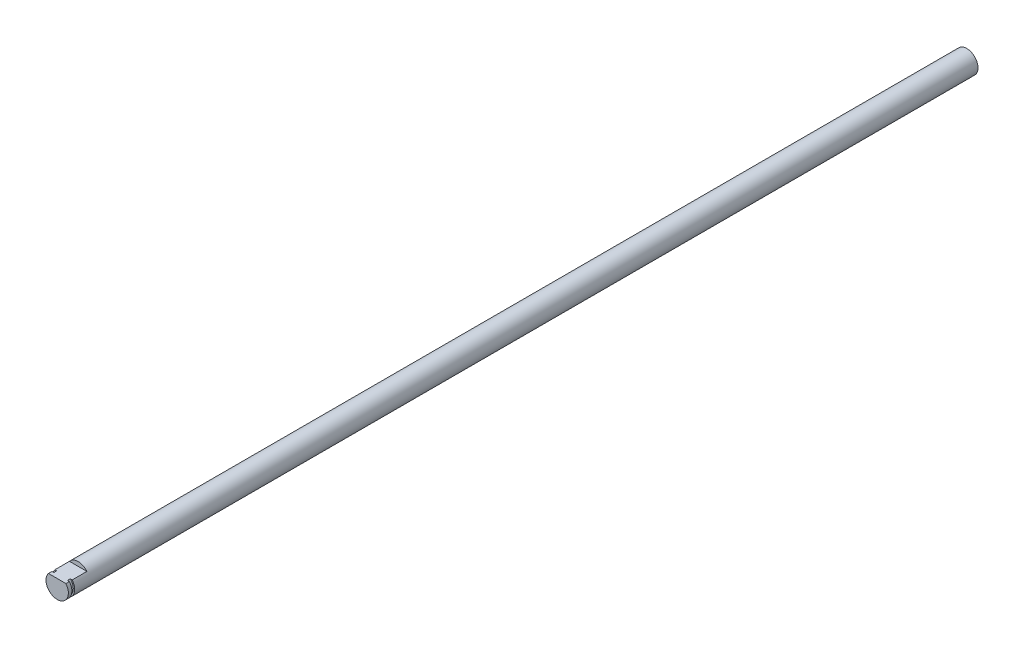
ISO-10303-21;
HEADER;
FILE_DESCRIPTION(('STEP AP214'),'2;1');
FILE_NAME('part.step','',(''),(''),'','','');
FILE_SCHEMA(('AUTOMOTIVE_DESIGN { 1 0 10303 214 1 1 1 1 }'));
ENDSEC;
DATA;
#1=APPLICATION_CONTEXT('core data for automotive mechanical design processes');
#2=APPLICATION_PROTOCOL_DEFINITION('international standard','automotive_design',2000,#1);
#3=PRODUCT_CONTEXT('',#1,'mechanical');
#4=PRODUCT('Part','Part','',(#3));
#5=PRODUCT_RELATED_PRODUCT_CATEGORY('part','',(#4));
#6=PRODUCT_DEFINITION_FORMATION('','',#4);
#7=PRODUCT_DEFINITION_CONTEXT('part definition',#1,'design');
#8=PRODUCT_DEFINITION('design','',#6,#7);
#9=PRODUCT_DEFINITION_SHAPE('','',#8);
#10=(LENGTH_UNIT() NAMED_UNIT(*) SI_UNIT(.MILLI.,.METRE.));
#11=(NAMED_UNIT(*) PLANE_ANGLE_UNIT() SI_UNIT($,.RADIAN.));
#12=(NAMED_UNIT(*) SI_UNIT($,.STERADIAN.) SOLID_ANGLE_UNIT());
#13=UNCERTAINTY_MEASURE_WITH_UNIT(LENGTH_MEASURE(1.E-05),#10,'distance_accuracy_value','');
#14=(GEOMETRIC_REPRESENTATION_CONTEXT(3) GLOBAL_UNCERTAINTY_ASSIGNED_CONTEXT((#13)) GLOBAL_UNIT_ASSIGNED_CONTEXT((#10,
#11,#12)) REPRESENTATION_CONTEXT('',''));
#15=CARTESIAN_POINT('',(0.,0.,0.));
#16=DIRECTION('',(0.,0.,1.));
#17=DIRECTION('',(1.,0.,0.));
#18=AXIS2_PLACEMENT_3D('',#15,#16,#17);
#19=CARTESIAN_POINT('',(0.,0.,325.));
#20=DIRECTION('',(0.,0.,-1.));
#21=DIRECTION('',(-1.,0.,0.));
#22=AXIS2_PLACEMENT_3D('',#19,#20,#21);
#23=CYLINDRICAL_SURFACE('',#22,4.);
#24=CARTESIAN_POINT('',(0.,0.,0.));
#25=DIRECTION('',(0.,0.,1.));
#26=DIRECTION('',(1.,0.,0.));
#27=AXIS2_PLACEMENT_3D('',#24,#25,#26);
#28=CIRCLE('',#27,4.);
#29=CARTESIAN_POINT('',(4.,0.,0.));
#30=VERTEX_POINT('',#29);
#31=EDGE_CURVE('E116',#30,#30,#28,.T.);
#32=ORIENTED_EDGE('',*,*,#31,.T.);
#33=EDGE_LOOP('',(#32));
#34=FACE_BOUND('',#33,.T.);
#35=CARTESIAN_POINT('',(0.,0.,322.75));
#36=DIRECTION('',(0.,0.,1.));
#37=DIRECTION('',(1.,0.,0.));
#38=AXIS2_PLACEMENT_3D('',#35,#36,#37);
#39=CIRCLE('',#38,4.);
#40=CARTESIAN_POINT('',(-3.1224989991992,2.5,322.75));
#41=VERTEX_POINT('',#40);
#42=CARTESIAN_POINT('',(3.1224989991992,2.5,322.75));
#43=VERTEX_POINT('',#42);
#44=EDGE_CURVE('E100',#41,#43,#39,.T.);
#45=ORIENTED_EDGE('',*,*,#44,.F.);
#46=DIRECTION('',(0.,0.,1.));
#47=VECTOR('',#46,1.);
#48=CARTESIAN_POINT('',(-3.1224989991992,2.5,317.5));
#49=LINE('',#48,#47);
#50=CARTESIAN_POINT('',(-3.1224989991992,2.5,317.5));
#51=VERTEX_POINT('',#50);
#52=EDGE_CURVE('E122',#51,#41,#49,.T.);
#53=ORIENTED_EDGE('',*,*,#52,.F.);
#54=CARTESIAN_POINT('',(0.,0.,317.5));
#55=DIRECTION('',(0.,0.,1.));
#56=DIRECTION('',(1.,0.,0.));
#57=AXIS2_PLACEMENT_3D('',#54,#55,#56);
#58=CIRCLE('',#57,4.);
#59=CARTESIAN_POINT('',(3.1224989991992,2.5,317.5));
#60=VERTEX_POINT('',#59);
#61=EDGE_CURVE('E129',#60,#51,#58,.T.);
#62=ORIENTED_EDGE('',*,*,#61,.F.);
#63=DIRECTION('',(0.,0.,1.));
#64=VECTOR('',#63,1.);
#65=CARTESIAN_POINT('',(3.1224989991992,2.5,317.5));
#66=LINE('',#65,#64);
#67=EDGE_CURVE('E119',#60,#43,#66,.T.);
#68=ORIENTED_EDGE('',*,*,#67,.T.);
#69=EDGE_LOOP('',(#45,#53,#62,#68));
#70=FACE_BOUND('',#69,.T.);
#71=ADVANCED_FACE('F39',(#34,#70),#23,.T.);
#72=CARTESIAN_POINT('',(3.1224989991992,2.5,317.5));
#73=DIRECTION('',(0.,-1.,0.));
#74=DIRECTION('',(0.,0.,-1.));
#75=AXIS2_PLACEMENT_3D('',#72,#73,#74);
#76=PLANE('',#75);
#77=DIRECTION('',(-1.,0.,0.));
#78=VECTOR('',#77,1.);
#79=CARTESIAN_POINT('',(3.1224989991992,2.5,322.75));
#80=LINE('',#79,#78);
#81=CARTESIAN_POINT('',(2.44948974278318,2.5,322.75));
#82=VERTEX_POINT('',#81);
#83=EDGE_CURVE('E11',#43,#82,#80,.T.);
#84=ORIENTED_EDGE('',*,*,#83,.F.);
#85=ORIENTED_EDGE('',*,*,#67,.F.);
#86=DIRECTION('',(1.,0.,0.));
#87=VECTOR('',#86,1.);
#88=CARTESIAN_POINT('',(3.1224989991992,2.5,317.5));
#89=LINE('',#88,#87);
#90=EDGE_CURVE('E130',#51,#60,#89,.T.);
#91=ORIENTED_EDGE('',*,*,#90,.F.);
#92=ORIENTED_EDGE('',*,*,#52,.T.);
#93=CARTESIAN_POINT('',(-2.44948974278318,2.5,322.75));
#94=VERTEX_POINT('',#93);
#95=EDGE_CURVE('E49',#94,#41,#80,.T.);
#96=ORIENTED_EDGE('',*,*,#95,.F.);
#97=DIRECTION('',(0.,0.,1.));
#98=VECTOR('',#97,1.);
#99=CARTESIAN_POINT('',(-2.44948974278318,2.5,322.75));
#100=LINE('',#99,#98);
#101=CARTESIAN_POINT('',(-2.44948974278318,2.5,323.75));
#102=VERTEX_POINT('',#101);
#103=EDGE_CURVE('E105',#102,#94,#100,.F.);
#104=ORIENTED_EDGE('',*,*,#103,.F.);
#105=DIRECTION('',(-1.,0.,0.));
#106=VECTOR('',#105,1.);
#107=CARTESIAN_POINT('',(3.1224989991992,2.5,323.75));
#108=LINE('',#107,#106);
#109=CARTESIAN_POINT('',(-3.1224989991992,2.5,323.75));
#110=VERTEX_POINT('',#109);
#111=EDGE_CURVE('E112',#102,#110,#108,.T.);
#112=ORIENTED_EDGE('',*,*,#111,.T.);
#113=CARTESIAN_POINT('',(-3.1224989991992,2.5,325.));
#114=VERTEX_POINT('',#113);
#115=EDGE_CURVE('E64',#110,#114,#49,.T.);
#116=ORIENTED_EDGE('',*,*,#115,.T.);
#117=DIRECTION('',(1.,0.,0.));
#118=VECTOR('',#117,1.);
#119=CARTESIAN_POINT('',(3.1224989991992,2.5,325.));
#120=LINE('',#119,#118);
#121=CARTESIAN_POINT('',(3.1224989991992,2.5,325.));
#122=VERTEX_POINT('',#121);
#123=EDGE_CURVE('E127',#114,#122,#120,.T.);
#124=ORIENTED_EDGE('',*,*,#123,.T.);
#125=CARTESIAN_POINT('',(3.1224989991992,2.5,323.75));
#126=VERTEX_POINT('',#125);
#127=EDGE_CURVE('E125',#126,#122,#66,.T.);
#128=ORIENTED_EDGE('',*,*,#127,.F.);
#129=CARTESIAN_POINT('',(2.44948974278318,2.5,323.75));
#130=VERTEX_POINT('',#129);
#131=EDGE_CURVE('E48',#126,#130,#108,.T.);
#132=ORIENTED_EDGE('',*,*,#131,.T.);
#133=DIRECTION('',(0.,0.,1.));
#134=VECTOR('',#133,1.);
#135=CARTESIAN_POINT('',(2.44948974278318,2.5,322.75));
#136=LINE('',#135,#134);
#137=EDGE_CURVE('E43',#82,#130,#136,.T.);
#138=ORIENTED_EDGE('',*,*,#137,.F.);
#139=EDGE_LOOP('',(#84,#85,#91,#92,#96,#104,#112,#116,#124,#128,#132,#138));
#140=FACE_BOUND('',#139,.T.);
#141=ADVANCED_FACE('F109',(#140),#76,.F.);
#142=ORIENTED_EDGE('',*,*,#115,.F.);
#143=CARTESIAN_POINT('',(0.,0.,323.75));
#144=DIRECTION('',(0.,0.,1.));
#145=DIRECTION('',(1.,0.,0.));
#146=AXIS2_PLACEMENT_3D('',#143,#144,#145);
#147=CIRCLE('',#146,4.);
#148=EDGE_CURVE('E106',#110,#126,#147,.T.);
#149=ORIENTED_EDGE('',*,*,#148,.T.);
#150=ORIENTED_EDGE('',*,*,#127,.T.);
#151=CARTESIAN_POINT('',(0.,0.,325.));
#152=DIRECTION('',(0.,0.,1.));
#153=DIRECTION('',(1.,0.,0.));
#154=AXIS2_PLACEMENT_3D('',#151,#152,#153);
#155=CIRCLE('',#154,4.);
#156=EDGE_CURVE('E115',#114,#122,#155,.T.);
#157=ORIENTED_EDGE('',*,*,#156,.F.);
#158=EDGE_LOOP('',(#142,#149,#150,#157));
#159=FACE_BOUND('',#158,.T.);
#160=ADVANCED_FACE('F41',(#159),#23,.T.);
#161=CARTESIAN_POINT('',(0.,0.,325.));
#162=DIRECTION('',(0.,0.,1.));
#163=DIRECTION('',(1.,0.,0.));
#164=AXIS2_PLACEMENT_3D('',#161,#162,#163);
#165=PLANE('',#164);
#166=ORIENTED_EDGE('',*,*,#123,.F.);
#167=ORIENTED_EDGE('',*,*,#156,.T.);
#168=EDGE_LOOP('',(#166,#167));
#169=FACE_BOUND('',#168,.T.);
#170=ADVANCED_FACE('F153',(#169),#165,.T.);
#171=CARTESIAN_POINT('',(0.,0.,0.));
#172=DIRECTION('',(0.,0.,1.));
#173=DIRECTION('',(1.,0.,0.));
#174=AXIS2_PLACEMENT_3D('',#171,#172,#173);
#175=PLANE('',#174);
#176=ORIENTED_EDGE('',*,*,#31,.F.);
#177=EDGE_LOOP('',(#176));
#178=FACE_BOUND('',#177,.T.);
#179=ADVANCED_FACE('F146',(#178),#175,.F.);
#180=CARTESIAN_POINT('',(0.,0.,317.5));
#181=DIRECTION('',(0.,0.,1.));
#182=DIRECTION('',(1.,0.,0.));
#183=AXIS2_PLACEMENT_3D('',#180,#181,#182);
#184=PLANE('',#183);
#185=ORIENTED_EDGE('',*,*,#61,.T.);
#186=ORIENTED_EDGE('',*,*,#90,.T.);
#187=EDGE_LOOP('',(#185,#186));
#188=FACE_BOUND('',#187,.T.);
#189=ADVANCED_FACE('F144',(#188),#184,.T.);
#190=CARTESIAN_POINT('',(0.,0.,322.75));
#191=DIRECTION('',(0.,0.,1.));
#192=DIRECTION('',(1.,0.,0.));
#193=AXIS2_PLACEMENT_3D('',#190,#191,#192);
#194=PLANE('',#193);
#195=ORIENTED_EDGE('',*,*,#83,.T.);
#196=CARTESIAN_POINT('',(0.,0.,322.75));
#197=DIRECTION('',(0.,0.,1.));
#198=DIRECTION('',(1.,0.,0.));
#199=AXIS2_PLACEMENT_3D('',#196,#197,#198);
#200=CIRCLE('',#199,3.5);
#201=EDGE_CURVE('E97',#94,#82,#200,.T.);
#202=ORIENTED_EDGE('',*,*,#201,.F.);
#203=ORIENTED_EDGE('',*,*,#95,.T.);
#204=ORIENTED_EDGE('',*,*,#44,.T.);
#205=EDGE_LOOP('',(#195,#202,#203,#204));
#206=FACE_BOUND('',#205,.T.);
#207=ADVANCED_FACE('F96',(#206),#194,.T.);
#208=CARTESIAN_POINT('',(0.,0.,323.75));
#209=DIRECTION('',(0.,0.,1.));
#210=DIRECTION('',(1.,0.,0.));
#211=AXIS2_PLACEMENT_3D('',#208,#209,#210);
#212=PLANE('',#211);
#213=ORIENTED_EDGE('',*,*,#148,.F.);
#214=ORIENTED_EDGE('',*,*,#111,.F.);
#215=CARTESIAN_POINT('',(0.,0.,323.75));
#216=DIRECTION('',(0.,0.,1.));
#217=DIRECTION('',(1.,0.,0.));
#218=AXIS2_PLACEMENT_3D('',#215,#216,#217);
#219=CIRCLE('',#218,3.5);
#220=EDGE_CURVE('E56',#102,#130,#219,.T.);
#221=ORIENTED_EDGE('',*,*,#220,.T.);
#222=ORIENTED_EDGE('',*,*,#131,.F.);
#223=EDGE_LOOP('',(#213,#214,#221,#222));
#224=FACE_BOUND('',#223,.T.);
#225=ADVANCED_FACE('F138',(#224),#212,.F.);
#226=CARTESIAN_POINT('',(0.,0.,322.75));
#227=DIRECTION('',(0.,0.,1.));
#228=DIRECTION('',(1.,0.,0.));
#229=AXIS2_PLACEMENT_3D('',#226,#227,#228);
#230=CYLINDRICAL_SURFACE('',#229,3.5);
#231=ORIENTED_EDGE('',*,*,#137,.T.);
#232=ORIENTED_EDGE('',*,*,#220,.F.);
#233=ORIENTED_EDGE('',*,*,#103,.T.);
#234=ORIENTED_EDGE('',*,*,#201,.T.);
#235=EDGE_LOOP('',(#231,#232,#233,#234));
#236=FACE_BOUND('',#235,.T.);
#237=ADVANCED_FACE('F103',(#236),#230,.T.);
#238=CLOSED_SHELL('',(#71,#141,#160,#170,#179,#189,#207,#225,#237));
#239=MANIFOLD_SOLID_BREP('B2',#238);
#240=ADVANCED_BREP_SHAPE_REPRESENTATION('',(#18,#239),#14);
#241=SHAPE_DEFINITION_REPRESENTATION(#9,#240);
ENDSEC;
END-ISO-10303-21;
